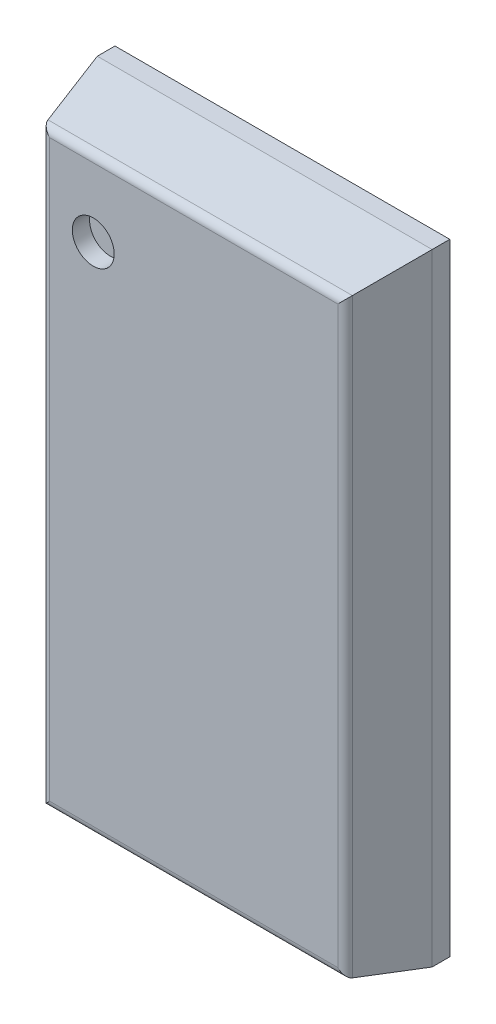
ISO-10303-21;
HEADER;
FILE_DESCRIPTION(('STEP AP214'),'2;1');
FILE_NAME('part.step','',(''),(''),'','','');
FILE_SCHEMA(('AUTOMOTIVE_DESIGN { 1 0 10303 214 1 1 1 1 }'));
ENDSEC;
DATA;
#1=APPLICATION_CONTEXT('core data for automotive mechanical design processes');
#2=APPLICATION_PROTOCOL_DEFINITION('international standard','automotive_design',2000,#1);
#3=PRODUCT_CONTEXT('',#1,'mechanical');
#4=PRODUCT('Part','Part','',(#3));
#5=PRODUCT_RELATED_PRODUCT_CATEGORY('part','',(#4));
#6=PRODUCT_DEFINITION_FORMATION('','',#4);
#7=PRODUCT_DEFINITION_CONTEXT('part definition',#1,'design');
#8=PRODUCT_DEFINITION('design','',#6,#7);
#9=PRODUCT_DEFINITION_SHAPE('','',#8);
#10=(LENGTH_UNIT() NAMED_UNIT(*) SI_UNIT(.MILLI.,.METRE.));
#11=(NAMED_UNIT(*) PLANE_ANGLE_UNIT() SI_UNIT($,.RADIAN.));
#12=(NAMED_UNIT(*) SI_UNIT($,.STERADIAN.) SOLID_ANGLE_UNIT());
#13=UNCERTAINTY_MEASURE_WITH_UNIT(LENGTH_MEASURE(1.E-05),#10,'distance_accuracy_value','');
#14=(GEOMETRIC_REPRESENTATION_CONTEXT(3) GLOBAL_UNCERTAINTY_ASSIGNED_CONTEXT((#13)) GLOBAL_UNIT_ASSIGNED_CONTEXT((#10,
#11,#12)) REPRESENTATION_CONTEXT('',''));
#15=CARTESIAN_POINT('',(0.,0.,0.));
#16=DIRECTION('',(0.,0.,1.));
#17=DIRECTION('',(1.,0.,0.));
#18=AXIS2_PLACEMENT_3D('',#15,#16,#17);
#19=CARTESIAN_POINT('',(-1.0515,2.29,1.62));
#20=DIRECTION('',(0.,0.,1.));
#21=DIRECTION('',(1.,0.,0.));
#22=AXIS2_PLACEMENT_3D('',#19,#20,#21);
#23=PLANE('',#22);
#24=CARTESIAN_POINT('',(-1.0515,2.29,1.62));
#25=DIRECTION('',(0.,0.,1.));
#26=DIRECTION('',(1.,0.,0.));
#27=AXIS2_PLACEMENT_3D('',#24,#25,#26);
#28=CIRCLE('',#27,0.2190625);
#29=CARTESIAN_POINT('',(-0.8324375,2.29,1.62));
#30=VERTEX_POINT('',#29);
#31=EDGE_CURVE('E20',#30,#30,#28,.T.);
#32=ORIENTED_EDGE('',*,*,#31,.T.);
#33=EDGE_LOOP('',(#32));
#34=FACE_BOUND('',#33,.T.);
#35=ADVANCED_FACE('F17',(#34),#23,.T.);
#36=CARTESIAN_POINT('',(-1.0515,2.29,1.62));
#37=DIRECTION('',(0.,0.,1.));
#38=DIRECTION('',(1.,0.,0.));
#39=AXIS2_PLACEMENT_3D('',#36,#37,#38);
#40=CYLINDRICAL_SURFACE('',#39,0.2190625);
#41=ORIENTED_EDGE('',*,*,#31,.F.);
#42=DIRECTION('',(0.,0.,1.));
#43=VECTOR('',#42,1.);
#44=CARTESIAN_POINT('',(-0.8324375,2.29,1.62));
#45=LINE('',#44,#43);
#46=CARTESIAN_POINT('',(-0.8324375,2.29,1.8));
#47=VERTEX_POINT('',#46);
#48=EDGE_CURVE('E11',#30,#47,#45,.T.);
#49=ORIENTED_EDGE('',*,*,#48,.T.);
#50=CARTESIAN_POINT('',(-1.0515,2.29,1.8));
#51=DIRECTION('',(0.,0.,1.));
#52=DIRECTION('',(1.,0.,0.));
#53=AXIS2_PLACEMENT_3D('',#50,#51,#52);
#54=CIRCLE('',#53,0.2190625);
#55=EDGE_CURVE('E303',#47,#47,#54,.T.);
#56=ORIENTED_EDGE('',*,*,#55,.T.);
#57=ORIENTED_EDGE('',*,*,#48,.F.);
#58=EDGE_LOOP('',(#41,#49,#56,#57));
#59=FACE_BOUND('',#58,.T.);
#60=ADVANCED_FACE('F336',(#59),#40,.F.);
#61=CARTESIAN_POINT('',(1.507884257852,-3.07725,1.712375));
#62=DIRECTION('',(0.,1.,0.));
#63=DIRECTION('',(0.,0.,1.));
#64=AXIS2_PLACEMENT_3D('',#61,#62,#63);
#65=CYLINDRICAL_SURFACE('',#64,0.087625);
#66=CARTESIAN_POINT('',(1.507884257852,-3.007884257852,1.712375));
#67=DIRECTION('',(-0.707106781186548,-0.707106781186548,0.));
#68=DIRECTION('',(0.707106781186548,-0.707106781186548,0.));
#69=AXIS2_PLACEMENT_3D('',#66,#67,#68);
#70=ELLIPSE('',#69,0.123920463403,0.087625);
#71=CARTESIAN_POINT('',(1.593170201742,-3.093170201742,1.732485902507));
#72=VERTEX_POINT('',#71);
#73=CARTESIAN_POINT('',(1.507884257852,-3.007884257852,1.8));
#74=VERTEX_POINT('',#73);
#75=EDGE_CURVE('E320',#72,#74,#70,.T.);
#76=ORIENTED_EDGE('',*,*,#75,.F.);
#77=DIRECTION('',(0.,1.,0.));
#78=VECTOR('',#77,1.);
#79=CARTESIAN_POINT('',(1.593170201742,-3.07725,1.732485902507));
#80=LINE('',#79,#78);
#81=CARTESIAN_POINT('',(1.593170201742,3.093170201742,1.732485902507));
#82=VERTEX_POINT('',#81);
#83=EDGE_CURVE('E316',#72,#82,#80,.T.);
#84=ORIENTED_EDGE('',*,*,#83,.T.);
#85=CARTESIAN_POINT('',(1.507884257852,3.007884257852,1.712375));
#86=DIRECTION('',(-0.707106781186548,0.707106781186548,0.));
#87=DIRECTION('',(0.707106781186548,0.707106781186548,0.));
#88=AXIS2_PLACEMENT_3D('',#85,#86,#87);
#89=ELLIPSE('',#88,0.123920463403,0.087625);
#90=CARTESIAN_POINT('',(1.507884257852,3.007884257852,1.8));
#91=VERTEX_POINT('',#90);
#92=EDGE_CURVE('E300',#91,#82,#89,.T.);
#93=ORIENTED_EDGE('',*,*,#92,.F.);
#94=DIRECTION('',(0.,1.,0.));
#95=VECTOR('',#94,1.);
#96=CARTESIAN_POINT('',(1.507884257852,-3.07725,1.8));
#97=LINE('',#96,#95);
#98=EDGE_CURVE('E189',#74,#91,#97,.T.);
#99=ORIENTED_EDGE('',*,*,#98,.F.);
#100=EDGE_LOOP('',(#76,#84,#93,#99));
#101=FACE_BOUND('',#100,.T.);
#102=ADVANCED_FACE('F383',(#101),#65,.T.);
#103=CARTESIAN_POINT('',(-1.57725,3.007884257852,1.712375));
#104=DIRECTION('',(1.,0.,0.));
#105=DIRECTION('',(0.,0.,1.));
#106=AXIS2_PLACEMENT_3D('',#103,#104,#105);
#107=CYLINDRICAL_SURFACE('',#106,0.087625);
#108=DIRECTION('',(1.,0.,0.));
#109=VECTOR('',#108,1.);
#110=CARTESIAN_POINT('',(-1.57725,3.007884257852,1.8));
#111=LINE('',#110,#109);
#112=CARTESIAN_POINT('',(-1.507884257852,3.007884257852,1.8));
#113=VERTEX_POINT('',#112);
#114=EDGE_CURVE('E193',#113,#91,#111,.T.);
#115=ORIENTED_EDGE('',*,*,#114,.T.);
#116=ORIENTED_EDGE('',*,*,#92,.T.);
#117=DIRECTION('',(1.,0.,0.));
#118=VECTOR('',#117,1.);
#119=CARTESIAN_POINT('',(-1.57725,3.093170201742,1.732485902507));
#120=LINE('',#119,#118);
#121=CARTESIAN_POINT('',(-1.593170201742,3.093170201742,1.732485902507));
#122=VERTEX_POINT('',#121);
#123=EDGE_CURVE('E311',#122,#82,#120,.T.);
#124=ORIENTED_EDGE('',*,*,#123,.F.);
#125=CARTESIAN_POINT('',(-1.507884257852,3.007884257852,1.712375));
#126=DIRECTION('',(0.707106781186548,0.707106781186548,0.));
#127=DIRECTION('',(-0.707106781186548,0.707106781186548,0.));
#128=AXIS2_PLACEMENT_3D('',#125,#126,#127);
#129=ELLIPSE('',#128,0.123920463403,0.087625);
#130=EDGE_CURVE('E307',#122,#113,#129,.T.);
#131=ORIENTED_EDGE('',*,*,#130,.T.);
#132=EDGE_LOOP('',(#115,#116,#124,#131));
#133=FACE_BOUND('',#132,.T.);
#134=ADVANCED_FACE('F342',(#133),#107,.T.);
#135=CARTESIAN_POINT('',(-1.7525,-3.2525,1.8));
#136=DIRECTION('',(0.,0.,1.));
#137=DIRECTION('',(1.,0.,0.));
#138=AXIS2_PLACEMENT_3D('',#135,#136,#137);
#139=PLANE('',#138);
#140=ORIENTED_EDGE('',*,*,#55,.F.);
#141=EDGE_LOOP('',(#140));
#142=FACE_BOUND('',#141,.T.);
#143=DIRECTION('',(0.,1.,0.));
#144=VECTOR('',#143,1.);
#145=CARTESIAN_POINT('',(-1.507884257852,-3.07725,1.8));
#146=LINE('',#145,#144);
#147=CARTESIAN_POINT('',(-1.507884257852,-3.007884257852,1.8));
#148=VERTEX_POINT('',#147);
#149=EDGE_CURVE('E299',#148,#113,#146,.T.);
#150=ORIENTED_EDGE('',*,*,#149,.F.);
#151=DIRECTION('',(1.,0.,0.));
#152=VECTOR('',#151,1.);
#153=CARTESIAN_POINT('',(-1.57725,-3.007884257852,1.8));
#154=LINE('',#153,#152);
#155=EDGE_CURVE('E194',#148,#74,#154,.T.);
#156=ORIENTED_EDGE('',*,*,#155,.T.);
#157=ORIENTED_EDGE('',*,*,#98,.T.);
#158=ORIENTED_EDGE('',*,*,#114,.F.);
#159=EDGE_LOOP('',(#150,#156,#157,#158));
#160=FACE_BOUND('',#159,.T.);
#161=ADVANCED_FACE('F338',(#142,#160),#139,.T.);
#162=CARTESIAN_POINT('',(-1.57725,-3.007884257852,1.712375));
#163=DIRECTION('',(1.,0.,0.));
#164=DIRECTION('',(0.,-0.973306064374652,0.229511012919918));
#165=AXIS2_PLACEMENT_3D('',#162,#163,#164);
#166=CYLINDRICAL_SURFACE('',#165,0.087625);
#167=DIRECTION('',(1.,0.,0.));
#168=VECTOR('',#167,1.);
#169=CARTESIAN_POINT('',(-1.57725,-3.093170201742,1.732485902507));
#170=LINE('',#169,#168);
#171=CARTESIAN_POINT('',(-1.593170201742,-3.093170201742,1.732485902507));
#172=VERTEX_POINT('',#171);
#173=EDGE_CURVE('E226',#172,#72,#170,.T.);
#174=ORIENTED_EDGE('',*,*,#173,.T.);
#175=ORIENTED_EDGE('',*,*,#75,.T.);
#176=ORIENTED_EDGE('',*,*,#155,.F.);
#177=CARTESIAN_POINT('',(-1.507884257852,-3.007884257852,1.712375));
#178=DIRECTION('',(-0.707106781186548,0.707106781186548,0.));
#179=DIRECTION('',(0.707106781186548,0.707106781186548,0.));
#180=AXIS2_PLACEMENT_3D('',#177,#178,#179);
#181=ELLIPSE('',#180,0.123920463403,0.087625);
#182=EDGE_CURVE('E281',#172,#148,#181,.T.);
#183=ORIENTED_EDGE('',*,*,#182,.F.);
#184=EDGE_LOOP('',(#174,#175,#176,#183));
#185=FACE_BOUND('',#184,.T.);
#186=ADVANCED_FACE('F341',(#185),#166,.T.);
#187=CARTESIAN_POINT('',(1.664875,-3.2525,1.42840151849));
#188=DIRECTION('',(0.973306064374652,0.,0.229511012919918));
#189=DIRECTION('',(0.,-1.,0.));
#190=AXIS2_PLACEMENT_3D('',#187,#188,#189);
#191=PLANE('',#190);
#192=DIRECTION('',(-0.223695018205087,0.223695018205087,0.948641701413369));
#193=VECTOR('',#192,1.);
#194=CARTESIAN_POINT('',(1.581565552085,-3.081565552085,1.781698686428));
#195=LINE('',#194,#193);
#196=CARTESIAN_POINT('',(1.7525,-3.2525,1.056803036979));
#197=VERTEX_POINT('',#196);
#198=EDGE_CURVE('E222',#197,#72,#195,.T.);
#199=ORIENTED_EDGE('',*,*,#198,.F.);
#200=DIRECTION('',(0.,1.,0.));
#201=VECTOR('',#200,1.);
#202=CARTESIAN_POINT('',(1.7525,-3.2525,1.056803036979));
#203=LINE('',#202,#201);
#204=CARTESIAN_POINT('',(1.7525,3.2525,1.056803036979));
#205=VERTEX_POINT('',#204);
#206=EDGE_CURVE('E227',#197,#205,#203,.T.);
#207=ORIENTED_EDGE('',*,*,#206,.T.);
#208=DIRECTION('',(-0.223695018205087,-0.223695018205087,0.948641701413369));
#209=VECTOR('',#208,1.);
#210=CARTESIAN_POINT('',(1.418812204631,2.918812204631,2.471900076154));
#211=LINE('',#210,#209);
#212=EDGE_CURVE('E315',#205,#82,#211,.T.);
#213=ORIENTED_EDGE('',*,*,#212,.T.);
#214=ORIENTED_EDGE('',*,*,#83,.F.);
#215=EDGE_LOOP('',(#199,#207,#213,#214));
#216=FACE_BOUND('',#215,.T.);
#217=ADVANCED_FACE('F380',(#216),#191,.T.);
#218=CARTESIAN_POINT('',(-1.7525,3.164875,1.42840151849));
#219=DIRECTION('',(0.,0.973306064374652,0.229511012919918));
#220=DIRECTION('',(1.,0.,0.));
#221=AXIS2_PLACEMENT_3D('',#218,#219,#220);
#222=PLANE('',#221);
#223=ORIENTED_EDGE('',*,*,#123,.T.);
#224=ORIENTED_EDGE('',*,*,#212,.F.);
#225=DIRECTION('',(1.,0.,0.));
#226=VECTOR('',#225,1.);
#227=CARTESIAN_POINT('',(-1.7525,3.2525,1.056803036979));
#228=LINE('',#227,#226);
#229=CARTESIAN_POINT('',(-1.7525,3.2525,1.056803036979));
#230=VERTEX_POINT('',#229);
#231=EDGE_CURVE('E289',#230,#205,#228,.T.);
#232=ORIENTED_EDGE('',*,*,#231,.F.);
#233=DIRECTION('',(0.223695018205087,-0.223695018205087,0.948641701413369));
#234=VECTOR('',#233,1.);
#235=CARTESIAN_POINT('',(-1.506506360331,3.006506360331,2.10000832043));
#236=LINE('',#235,#234);
#237=EDGE_CURVE('E273',#230,#122,#236,.T.);
#238=ORIENTED_EDGE('',*,*,#237,.T.);
#239=EDGE_LOOP('',(#223,#224,#232,#238));
#240=FACE_BOUND('',#239,.T.);
#241=ADVANCED_FACE('F385',(#240),#222,.T.);
#242=CARTESIAN_POINT('',(-1.507884257852,-3.07725,1.712375));
#243=DIRECTION('',(0.,1.,0.));
#244=DIRECTION('',(-0.973306064374652,0.,0.229511012919918));
#245=AXIS2_PLACEMENT_3D('',#242,#243,#244);
#246=CYLINDRICAL_SURFACE('',#245,0.087625);
#247=ORIENTED_EDGE('',*,*,#182,.T.);
#248=ORIENTED_EDGE('',*,*,#149,.T.);
#249=ORIENTED_EDGE('',*,*,#130,.F.);
#250=DIRECTION('',(0.,1.,0.));
#251=VECTOR('',#250,1.);
#252=CARTESIAN_POINT('',(-1.593170201742,-3.07725,1.732485902507));
#253=LINE('',#252,#251);
#254=EDGE_CURVE('E197',#172,#122,#253,.T.);
#255=ORIENTED_EDGE('',*,*,#254,.F.);
#256=EDGE_LOOP('',(#247,#248,#249,#255));
#257=FACE_BOUND('',#256,.T.);
#258=ADVANCED_FACE('F348',(#257),#246,.T.);
#259=CARTESIAN_POINT('',(-1.7525,-3.164875,1.42840151849));
#260=DIRECTION('',(0.,0.973306064374652,-0.229511012919918));
#261=DIRECTION('',(-1.,0.,0.));
#262=AXIS2_PLACEMENT_3D('',#259,#260,#261);
#263=PLANE('',#262);
#264=DIRECTION('',(0.223695018205087,0.223695018205087,0.948641701413369));
#265=VECTOR('',#264,1.);
#266=CARTESIAN_POINT('',(-1.669259707785,-3.169259707785,1.409806930703));
#267=LINE('',#266,#265);
#268=CARTESIAN_POINT('',(-1.7525,-3.2525,1.056803036979));
#269=VERTEX_POINT('',#268);
#270=EDGE_CURVE('E277',#269,#172,#267,.T.);
#271=ORIENTED_EDGE('',*,*,#270,.F.);
#272=DIRECTION('',(1.,0.,0.));
#273=VECTOR('',#272,1.);
#274=CARTESIAN_POINT('',(-1.7525,-3.2525,1.056803036979));
#275=LINE('',#274,#273);
#276=EDGE_CURVE('E148',#269,#197,#275,.T.);
#277=ORIENTED_EDGE('',*,*,#276,.T.);
#278=ORIENTED_EDGE('',*,*,#198,.T.);
#279=ORIENTED_EDGE('',*,*,#173,.F.);
#280=EDGE_LOOP('',(#271,#277,#278,#279));
#281=FACE_BOUND('',#280,.T.);
#282=ADVANCED_FACE('F352',(#281),#263,.F.);
#283=CARTESIAN_POINT('',(1.7525,-3.2525,0.74));
#284=DIRECTION('',(1.,0.,0.));
#285=DIRECTION('',(0.,1.,0.));
#286=AXIS2_PLACEMENT_3D('',#283,#284,#285);
#287=PLANE('',#286);
#288=DIRECTION('',(0.,0.,1.));
#289=VECTOR('',#288,1.);
#290=CARTESIAN_POINT('',(1.7525,-3.2525,0.74));
#291=LINE('',#290,#289);
#292=CARTESIAN_POINT('',(1.7525,-3.2525,0.871803036979));
#293=VERTEX_POINT('',#292);
#294=EDGE_CURVE('E252',#293,#197,#291,.T.);
#295=ORIENTED_EDGE('',*,*,#294,.F.);
#296=DIRECTION('',(0.,1.,0.));
#297=VECTOR('',#296,1.);
#298=CARTESIAN_POINT('',(1.7525,-3.2525,0.871803036979));
#299=LINE('',#298,#297);
#300=CARTESIAN_POINT('',(1.7525,3.2525,0.871803036979));
#301=VERTEX_POINT('',#300);
#302=EDGE_CURVE('E205',#293,#301,#299,.T.);
#303=ORIENTED_EDGE('',*,*,#302,.T.);
#304=DIRECTION('',(0.,0.,1.));
#305=VECTOR('',#304,1.);
#306=CARTESIAN_POINT('',(1.7525,3.2525,0.74));
#307=LINE('',#306,#305);
#308=EDGE_CURVE('E285',#301,#205,#307,.T.);
#309=ORIENTED_EDGE('',*,*,#308,.T.);
#310=ORIENTED_EDGE('',*,*,#206,.F.);
#311=EDGE_LOOP('',(#295,#303,#309,#310));
#312=FACE_BOUND('',#311,.T.);
#313=ADVANCED_FACE('F378',(#312),#287,.T.);
#314=CARTESIAN_POINT('',(1.547976732908,-3.07725,0.827625));
#315=DIRECTION('',(0.,1.,0.));
#316=DIRECTION('',(0.,0.,-1.));
#317=AXIS2_PLACEMENT_3D('',#314,#315,#316);
#318=CYLINDRICAL_SURFACE('',#317,0.087625);
#319=DIRECTION('',(0.,1.,0.));
#320=VECTOR('',#319,1.);
#321=CARTESIAN_POINT('',(1.547976732908,-3.07725,0.74));
#322=LINE('',#321,#320);
#323=CARTESIAN_POINT('',(1.547976732908,-3.047976732908,0.74));
#324=VERTEX_POINT('',#323);
#325=CARTESIAN_POINT('',(1.547976732908,3.047976732908,0.74));
#326=VERTEX_POINT('',#325);
#327=EDGE_CURVE('E198',#324,#326,#322,.T.);
#328=ORIENTED_EDGE('',*,*,#327,.T.);
#329=CARTESIAN_POINT('',(1.547976732908,3.047976732908,0.827625));
#330=DIRECTION('',(0.707106781186548,-0.707106781186548,0.));
#331=DIRECTION('',(0.707106781186548,0.707106781186548,0.));
#332=AXIS2_PLACEMENT_3D('',#329,#330,#331);
#333=ELLIPSE('',#332,0.123920463403,0.087625);
#334=CARTESIAN_POINT('',(1.600645169946,3.100645169946,0.757595175176));
#335=VERTEX_POINT('',#334);
#336=EDGE_CURVE('E195',#326,#335,#333,.T.);
#337=ORIENTED_EDGE('',*,*,#336,.T.);
#338=DIRECTION('',(0.,1.,0.));
#339=VECTOR('',#338,1.);
#340=CARTESIAN_POINT('',(1.600645169946,-3.07725,0.757595175176));
#341=LINE('',#340,#339);
#342=CARTESIAN_POINT('',(1.600645169946,-3.100645169946,0.757595175176));
#343=VERTEX_POINT('',#342);
#344=EDGE_CURVE('E210',#343,#335,#341,.T.);
#345=ORIENTED_EDGE('',*,*,#344,.F.);
#346=CARTESIAN_POINT('',(1.547976732908,-3.047976732908,0.827625));
#347=DIRECTION('',(0.707106781186548,0.707106781186548,0.));
#348=DIRECTION('',(0.707106781186548,-0.707106781186548,0.));
#349=AXIS2_PLACEMENT_3D('',#346,#347,#348);
#350=ELLIPSE('',#349,0.123920463403,0.087625);
#351=EDGE_CURVE('E259',#343,#324,#350,.T.);
#352=ORIENTED_EDGE('',*,*,#351,.T.);
#353=EDGE_LOOP('',(#328,#337,#345,#352));
#354=FACE_BOUND('',#353,.T.);
#355=ADVANCED_FACE('F652',(#354),#318,.T.);
#356=CARTESIAN_POINT('',(-1.7525,3.2525,0.74));
#357=DIRECTION('',(0.,1.,0.));
#358=DIRECTION('',(1.,0.,0.));
#359=AXIS2_PLACEMENT_3D('',#356,#357,#358);
#360=PLANE('',#359);
#361=ORIENTED_EDGE('',*,*,#308,.F.);
#362=DIRECTION('',(1.,0.,0.));
#363=VECTOR('',#362,1.);
#364=CARTESIAN_POINT('',(-1.7525,3.2525,0.871803036979));
#365=LINE('',#364,#363);
#366=CARTESIAN_POINT('',(-1.7525,3.2525,0.871803036979));
#367=VERTEX_POINT('',#366);
#368=EDGE_CURVE('E154',#367,#301,#365,.T.);
#369=ORIENTED_EDGE('',*,*,#368,.F.);
#370=DIRECTION('',(0.,0.,1.));
#371=VECTOR('',#370,1.);
#372=CARTESIAN_POINT('',(-1.7525,3.2525,0.74));
#373=LINE('',#372,#371);
#374=EDGE_CURVE('E155',#367,#230,#373,.T.);
#375=ORIENTED_EDGE('',*,*,#374,.T.);
#376=ORIENTED_EDGE('',*,*,#231,.T.);
#377=EDGE_LOOP('',(#361,#369,#375,#376));
#378=FACE_BOUND('',#377,.T.);
#379=ADVANCED_FACE('F358',(#378),#360,.T.);
#380=CARTESIAN_POINT('',(-1.664875,-3.2525,1.42840151849));
#381=DIRECTION('',(0.973306064374652,0.,-0.229511012919918));
#382=DIRECTION('',(0.,-1.,0.));
#383=AXIS2_PLACEMENT_3D('',#380,#381,#382);
#384=PLANE('',#383);
#385=ORIENTED_EDGE('',*,*,#254,.T.);
#386=ORIENTED_EDGE('',*,*,#237,.F.);
#387=DIRECTION('',(0.,1.,0.));
#388=VECTOR('',#387,1.);
#389=CARTESIAN_POINT('',(-1.7525,-3.2525,1.056803036979));
#390=LINE('',#389,#388);
#391=EDGE_CURVE('E215',#269,#230,#390,.T.);
#392=ORIENTED_EDGE('',*,*,#391,.F.);
#393=ORIENTED_EDGE('',*,*,#270,.T.);
#394=EDGE_LOOP('',(#385,#386,#392,#393));
#395=FACE_BOUND('',#394,.T.);
#396=ADVANCED_FACE('F354',(#395),#384,.F.);
#397=CARTESIAN_POINT('',(-1.57725,3.047976732908,0.827625));
#398=DIRECTION('',(1.,0.,0.));
#399=DIRECTION('',(0.,0.,-1.));
#400=AXIS2_PLACEMENT_3D('',#397,#398,#399);
#401=CYLINDRICAL_SURFACE('',#400,0.087625);
#402=CARTESIAN_POINT('',(-1.547976732908,3.047976732908,0.827625));
#403=DIRECTION('',(-0.707106781186548,-0.707106781186548,0.));
#404=DIRECTION('',(-0.707106781186548,0.707106781186548,0.));
#405=AXIS2_PLACEMENT_3D('',#402,#403,#404);
#406=ELLIPSE('',#405,0.123920463403,0.087625);
#407=CARTESIAN_POINT('',(-1.600645169946,3.100645169946,0.757595175176));
#408=VERTEX_POINT('',#407);
#409=CARTESIAN_POINT('',(-1.547976732908,3.047976732908,0.74));
#410=VERTEX_POINT('',#409);
#411=EDGE_CURVE('E166',#408,#410,#406,.T.);
#412=ORIENTED_EDGE('',*,*,#411,.F.);
#413=DIRECTION('',(1.,0.,0.));
#414=VECTOR('',#413,1.);
#415=CARTESIAN_POINT('',(-1.57725,3.100645169946,0.757595175176));
#416=LINE('',#415,#414);
#417=EDGE_CURVE('E204',#408,#335,#416,.T.);
#418=ORIENTED_EDGE('',*,*,#417,.T.);
#419=ORIENTED_EDGE('',*,*,#336,.F.);
#420=DIRECTION('',(1.,0.,0.));
#421=VECTOR('',#420,1.);
#422=CARTESIAN_POINT('',(-1.57725,3.047976732908,0.74));
#423=LINE('',#422,#421);
#424=EDGE_CURVE('E209',#410,#326,#423,.T.);
#425=ORIENTED_EDGE('',*,*,#424,.F.);
#426=EDGE_LOOP('',(#412,#418,#419,#425));
#427=FACE_BOUND('',#426,.T.);
#428=ADVANCED_FACE('F364',(#427),#401,.T.);
#429=CARTESIAN_POINT('',(-1.7525,-3.2525,0.74));
#430=DIRECTION('',(0.,0.,1.));
#431=DIRECTION('',(1.,0.,0.));
#432=AXIS2_PLACEMENT_3D('',#429,#430,#431);
#433=PLANE('',#432);
#434=ORIENTED_EDGE('',*,*,#424,.T.);
#435=ORIENTED_EDGE('',*,*,#327,.F.);
#436=DIRECTION('',(1.,0.,0.));
#437=VECTOR('',#436,1.);
#438=CARTESIAN_POINT('',(-1.57725,-3.047976732908,0.74));
#439=LINE('',#438,#437);
#440=CARTESIAN_POINT('',(-1.547976732908,-3.047976732908,0.74));
#441=VERTEX_POINT('',#440);
#442=EDGE_CURVE('E248',#441,#324,#439,.T.);
#443=ORIENTED_EDGE('',*,*,#442,.F.);
#444=DIRECTION('',(0.,1.,0.));
#445=VECTOR('',#444,1.);
#446=CARTESIAN_POINT('',(-1.547976732908,-3.07725,0.74));
#447=LINE('',#446,#445);
#448=EDGE_CURVE('E216',#441,#410,#447,.T.);
#449=ORIENTED_EDGE('',*,*,#448,.T.);
#450=EDGE_LOOP('',(#434,#435,#443,#449));
#451=FACE_BOUND('',#450,.T.);
#452=ADVANCED_FACE('F612',(#451),#433,.F.);
#453=CARTESIAN_POINT('',(1.664875,-3.2525,0.80590151849));
#454=DIRECTION('',(-0.601066328540768,0.,0.799199142075692));
#455=DIRECTION('',(0.,1.,0.));
#456=AXIS2_PLACEMENT_3D('',#453,#454,#455);
#457=PLANE('',#456);
#458=ORIENTED_EDGE('',*,*,#344,.T.);
#459=DIRECTION('',(-0.624313503926429,-0.624313503926429,-0.469537322936323));
#460=VECTOR('',#459,1.);
#461=CARTESIAN_POINT('',(-0.251757228533,1.248242771467,-0.635570370199));
#462=LINE('',#461,#460);
#463=EDGE_CURVE('E200',#301,#335,#462,.T.);
#464=ORIENTED_EDGE('',*,*,#463,.F.);
#465=ORIENTED_EDGE('',*,*,#302,.F.);
#466=DIRECTION('',(-0.624313503926429,0.624313503926429,-0.469537322936323));
#467=VECTOR('',#466,1.);
#468=CARTESIAN_POINT('',(1.015961081196,-2.515961081196,0.317862572775));
#469=LINE('',#468,#467);
#470=EDGE_CURVE('E164',#293,#343,#469,.T.);
#471=ORIENTED_EDGE('',*,*,#470,.T.);
#472=EDGE_LOOP('',(#458,#464,#465,#471));
#473=FACE_BOUND('',#472,.T.);
#474=ADVANCED_FACE('F374',(#473),#457,.F.);
#475=CARTESIAN_POINT('',(-1.7525,-3.2525,0.74));
#476=DIRECTION('',(0.,1.,0.));
#477=DIRECTION('',(1.,0.,0.));
#478=AXIS2_PLACEMENT_3D('',#475,#476,#477);
#479=PLANE('',#478);
#480=ORIENTED_EDGE('',*,*,#276,.F.);
#481=DIRECTION('',(0.,0.,1.));
#482=VECTOR('',#481,1.);
#483=CARTESIAN_POINT('',(-1.7525,-3.2525,0.74));
#484=LINE('',#483,#482);
#485=CARTESIAN_POINT('',(-1.7525,-3.2525,0.871803036979));
#486=VERTEX_POINT('',#485);
#487=EDGE_CURVE('E141',#486,#269,#484,.T.);
#488=ORIENTED_EDGE('',*,*,#487,.F.);
#489=DIRECTION('',(1.,0.,0.));
#490=VECTOR('',#489,1.);
#491=CARTESIAN_POINT('',(-1.7525,-3.2525,0.871803036979));
#492=LINE('',#491,#490);
#493=EDGE_CURVE('E145',#486,#293,#492,.T.);
#494=ORIENTED_EDGE('',*,*,#493,.T.);
#495=ORIENTED_EDGE('',*,*,#294,.T.);
#496=EDGE_LOOP('',(#480,#488,#494,#495));
#497=FACE_BOUND('',#496,.T.);
#498=ADVANCED_FACE('F143',(#497),#479,.F.);
#499=CARTESIAN_POINT('',(-1.57725,-3.047976732908,0.827625));
#500=DIRECTION('',(1.,0.,0.));
#501=DIRECTION('',(0.,-0.601066328540768,-0.799199142075692));
#502=AXIS2_PLACEMENT_3D('',#499,#500,#501);
#503=CYLINDRICAL_SURFACE('',#502,0.087625);
#504=CARTESIAN_POINT('',(-1.547976732908,-3.047976732908,0.827625));
#505=DIRECTION('',(0.707106781186548,-0.707106781186548,0.));
#506=DIRECTION('',(0.707106781186548,0.707106781186548,0.));
#507=AXIS2_PLACEMENT_3D('',#504,#505,#506);
#508=ELLIPSE('',#507,0.123920463403,0.087625);
#509=CARTESIAN_POINT('',(-1.600645169946,-3.100645169946,0.757595175176));
#510=VERTEX_POINT('',#509);
#511=EDGE_CURVE('E211',#510,#441,#508,.T.);
#512=ORIENTED_EDGE('',*,*,#511,.T.);
#513=ORIENTED_EDGE('',*,*,#442,.T.);
#514=ORIENTED_EDGE('',*,*,#351,.F.);
#515=DIRECTION('',(1.,0.,0.));
#516=VECTOR('',#515,1.);
#517=CARTESIAN_POINT('',(-1.57725,-3.100645169946,0.757595175176));
#518=LINE('',#517,#516);
#519=EDGE_CURVE('E230',#510,#343,#518,.T.);
#520=ORIENTED_EDGE('',*,*,#519,.F.);
#521=EDGE_LOOP('',(#512,#513,#514,#520));
#522=FACE_BOUND('',#521,.T.);
#523=ADVANCED_FACE('F371',(#522),#503,.T.);
#524=CARTESIAN_POINT('',(-1.7525,3.164875,0.80590151849));
#525=DIRECTION('',(0.,-0.601066328540768,0.799199142075692));
#526=DIRECTION('',(-1.,0.,0.));
#527=AXIS2_PLACEMENT_3D('',#524,#525,#526);
#528=PLANE('',#527);
#529=DIRECTION('',(0.624313503926429,-0.624313503926429,-0.469537322936323));
#530=VECTOR('',#529,1.);
#531=CARTESIAN_POINT('',(-0.431310054419,1.931310054419,-0.121845164185));
#532=LINE('',#531,#530);
#533=EDGE_CURVE('E177',#367,#408,#532,.T.);
#534=ORIENTED_EDGE('',*,*,#533,.F.);
#535=ORIENTED_EDGE('',*,*,#368,.T.);
#536=ORIENTED_EDGE('',*,*,#463,.T.);
#537=ORIENTED_EDGE('',*,*,#417,.F.);
#538=EDGE_LOOP('',(#534,#535,#536,#537));
#539=FACE_BOUND('',#538,.T.);
#540=ADVANCED_FACE('F360',(#539),#528,.F.);
#541=CARTESIAN_POINT('',(-1.7525,-3.2525,0.74));
#542=DIRECTION('',(1.,0.,0.));
#543=DIRECTION('',(0.,1.,0.));
#544=AXIS2_PLACEMENT_3D('',#541,#542,#543);
#545=PLANE('',#544);
#546=ORIENTED_EDGE('',*,*,#391,.T.);
#547=ORIENTED_EDGE('',*,*,#374,.F.);
#548=DIRECTION('',(0.,1.,0.));
#549=VECTOR('',#548,1.);
#550=CARTESIAN_POINT('',(-1.7525,-3.2525,0.871803036979));
#551=LINE('',#550,#549);
#552=EDGE_CURVE('E170',#486,#367,#551,.T.);
#553=ORIENTED_EDGE('',*,*,#552,.F.);
#554=ORIENTED_EDGE('',*,*,#487,.T.);
#555=EDGE_LOOP('',(#546,#547,#553,#554));
#556=FACE_BOUND('',#555,.T.);
#557=ADVANCED_FACE('F171',(#556),#545,.F.);
#558=CARTESIAN_POINT('',(-1.547976732908,-3.07725,0.827625));
#559=DIRECTION('',(0.,1.,0.));
#560=DIRECTION('',(-0.601066328540768,0.,-0.799199142075692));
#561=AXIS2_PLACEMENT_3D('',#558,#559,#560);
#562=CYLINDRICAL_SURFACE('',#561,0.087625);
#563=DIRECTION('',(0.,1.,0.));
#564=VECTOR('',#563,1.);
#565=CARTESIAN_POINT('',(-1.600645169946,-3.07725,0.757595175176));
#566=LINE('',#565,#564);
#567=EDGE_CURVE('E182',#510,#408,#566,.T.);
#568=ORIENTED_EDGE('',*,*,#567,.T.);
#569=ORIENTED_EDGE('',*,*,#411,.T.);
#570=ORIENTED_EDGE('',*,*,#448,.F.);
#571=ORIENTED_EDGE('',*,*,#511,.F.);
#572=EDGE_LOOP('',(#568,#569,#570,#571));
#573=FACE_BOUND('',#572,.T.);
#574=ADVANCED_FACE('F367',(#573),#562,.T.);
#575=CARTESIAN_POINT('',(-1.7525,-3.164875,0.80590151849));
#576=DIRECTION('',(0.,-0.601066328540768,-0.799199142075692));
#577=DIRECTION('',(0.,-0.799199142075692,0.601066328540768));
#578=AXIS2_PLACEMENT_3D('',#575,#576,#577);
#579=PLANE('',#578);
#580=ORIENTED_EDGE('',*,*,#519,.T.);
#581=ORIENTED_EDGE('',*,*,#470,.F.);
#582=ORIENTED_EDGE('',*,*,#493,.F.);
#583=DIRECTION('',(0.624313503926429,0.624313503926429,-0.469537322936323));
#584=VECTOR('',#583,1.);
#585=CARTESIAN_POINT('',(-1.699028364148,-3.199028364148,0.83158777879));
#586=LINE('',#585,#584);
#587=EDGE_CURVE('E162',#486,#510,#586,.T.);
#588=ORIENTED_EDGE('',*,*,#587,.T.);
#589=EDGE_LOOP('',(#580,#581,#582,#588));
#590=FACE_BOUND('',#589,.T.);
#591=ADVANCED_FACE('F160',(#590),#579,.T.);
#592=CARTESIAN_POINT('',(-1.664875,-3.2525,0.80590151849));
#593=DIRECTION('',(-0.601066328540768,0.,-0.799199142075692));
#594=DIRECTION('',(-0.799199142075692,0.,0.601066328540768));
#595=AXIS2_PLACEMENT_3D('',#592,#593,#594);
#596=PLANE('',#595);
#597=ORIENTED_EDGE('',*,*,#587,.F.);
#598=ORIENTED_EDGE('',*,*,#552,.T.);
#599=ORIENTED_EDGE('',*,*,#533,.T.);
#600=ORIENTED_EDGE('',*,*,#567,.F.);
#601=EDGE_LOOP('',(#597,#598,#599,#600));
#602=FACE_BOUND('',#601,.T.);
#603=ADVANCED_FACE('F180',(#602),#596,.T.);
#604=CLOSED_SHELL('',(#35,#60,#102,#134,#161,#186,#217,#241,#258,#282,#313,#355,#379,#396,#428,
#452,#474,#498,#523,#540,#557,#574,#591,#603));
#605=MANIFOLD_SOLID_BREP('B1',#604);
#606=ADVANCED_BREP_SHAPE_REPRESENTATION('',(#18,#605),#14);
#607=SHAPE_DEFINITION_REPRESENTATION(#9,#606);
ENDSEC;
END-ISO-10303-21;
